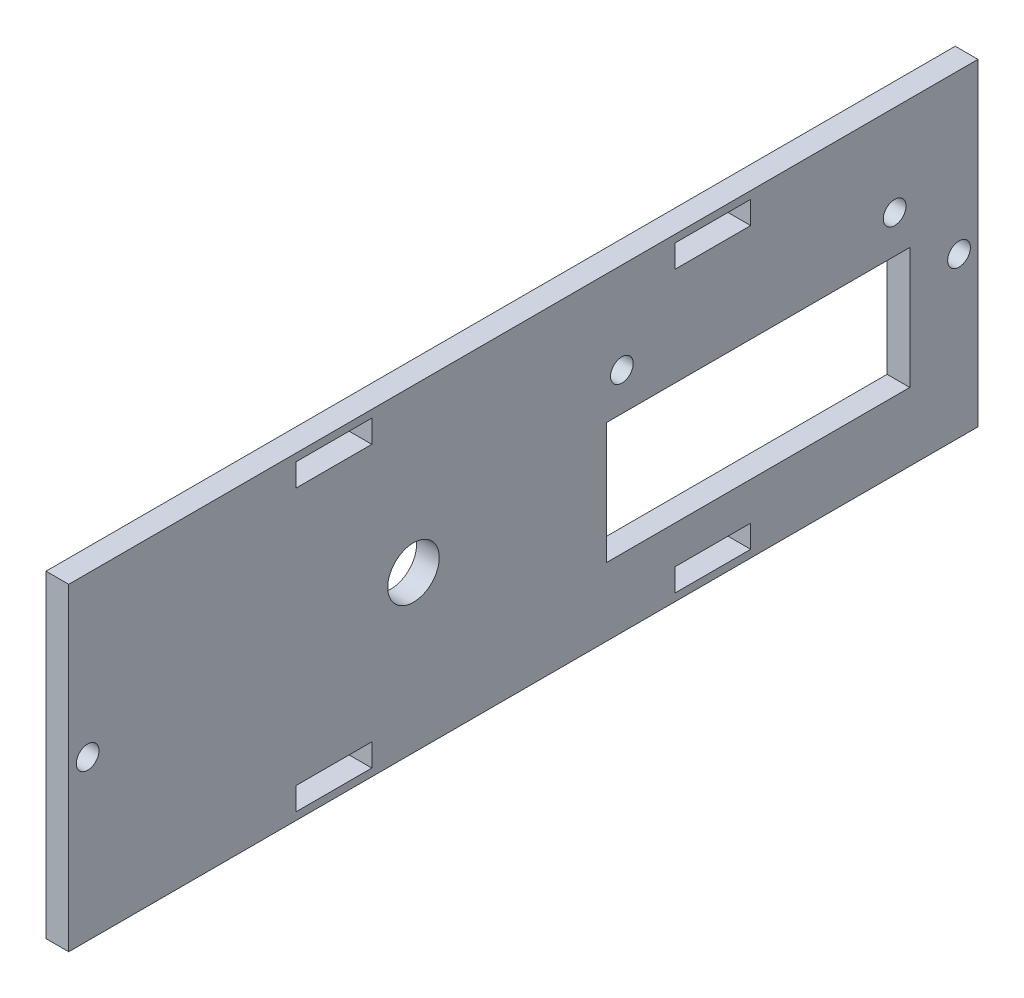
ISO-10303-21;
HEADER;
FILE_DESCRIPTION(('STEP AP214'),'2;1');
FILE_NAME('part.step','',(''),(''),'','','');
FILE_SCHEMA(('AUTOMOTIVE_DESIGN { 1 0 10303 214 1 1 1 1 }'));
ENDSEC;
DATA;
#1=APPLICATION_CONTEXT('core data for automotive mechanical design processes');
#2=APPLICATION_PROTOCOL_DEFINITION('international standard','automotive_design',2000,#1);
#3=PRODUCT_CONTEXT('',#1,'mechanical');
#4=PRODUCT('Part','Part','',(#3));
#5=PRODUCT_RELATED_PRODUCT_CATEGORY('part','',(#4));
#6=PRODUCT_DEFINITION_FORMATION('','',#4);
#7=PRODUCT_DEFINITION_CONTEXT('part definition',#1,'design');
#8=PRODUCT_DEFINITION('design','',#6,#7);
#9=PRODUCT_DEFINITION_SHAPE('','',#8);
#10=(LENGTH_UNIT() NAMED_UNIT(*) SI_UNIT(.MILLI.,.METRE.));
#11=(NAMED_UNIT(*) PLANE_ANGLE_UNIT() SI_UNIT($,.RADIAN.));
#12=(NAMED_UNIT(*) SI_UNIT($,.STERADIAN.) SOLID_ANGLE_UNIT());
#13=UNCERTAINTY_MEASURE_WITH_UNIT(LENGTH_MEASURE(1.E-05),#10,'distance_accuracy_value','');
#14=(GEOMETRIC_REPRESENTATION_CONTEXT(3) GLOBAL_UNCERTAINTY_ASSIGNED_CONTEXT((#13)) GLOBAL_UNIT_ASSIGNED_CONTEXT((#10,
#11,#12)) REPRESENTATION_CONTEXT('',''));
#15=CARTESIAN_POINT('',(0.,0.,0.));
#16=DIRECTION('',(0.,0.,1.));
#17=DIRECTION('',(1.,0.,0.));
#18=AXIS2_PLACEMENT_3D('',#15,#16,#17);
#19=CARTESIAN_POINT('',(3.,0.,0.));
#20=DIRECTION('',(1.,0.,0.));
#21=DIRECTION('',(0.,0.,-1.));
#22=AXIS2_PLACEMENT_3D('',#19,#20,#21);
#23=PLANE('',#22);
#24=CARTESIAN_POINT('',(3.,-0.399999999999994,14.5));
#25=DIRECTION('',(1.,0.,0.));
#26=DIRECTION('',(0.,0.,-1.));
#27=AXIS2_PLACEMENT_3D('',#24,#25,#26);
#28=CIRCLE('',#27,3.4);
#29=CARTESIAN_POINT('',(3.,-0.399999999999994,11.1));
#30=VERTEX_POINT('',#29);
#31=EDGE_CURVE('E562',#30,#30,#28,.T.);
#32=ORIENTED_EDGE('',*,*,#31,.F.);
#33=EDGE_LOOP('',(#32));
#34=FACE_BOUND('',#33,.T.);
#35=CARTESIAN_POINT('',(3.,9.00000000000002,-49.));
#36=DIRECTION('',(1.,0.,0.));
#37=DIRECTION('',(0.,0.,-1.));
#38=AXIS2_PLACEMENT_3D('',#35,#36,#37);
#39=CIRCLE('',#38,1.5);
#40=CARTESIAN_POINT('',(3.,9.00000000000002,-50.5));
#41=VERTEX_POINT('',#40);
#42=EDGE_CURVE('E223',#41,#41,#39,.T.);
#43=ORIENTED_EDGE('',*,*,#42,.F.);
#44=EDGE_LOOP('',(#43));
#45=FACE_BOUND('',#44,.T.);
#46=DIRECTION('',(0.,-1.,0.));
#47=VECTOR('',#46,1.);
#48=CARTESIAN_POINT('',(3.,-21.,60.));
#49=LINE('',#48,#47);
#50=CARTESIAN_POINT('',(3.,21.,60.));
#51=VERTEX_POINT('',#50);
#52=CARTESIAN_POINT('',(3.,-21.,60.));
#53=VERTEX_POINT('',#52);
#54=EDGE_CURVE('E363',#51,#53,#49,.T.);
#55=ORIENTED_EDGE('',*,*,#54,.T.);
#56=DIRECTION('',(0.,0.,-1.));
#57=VECTOR('',#56,1.);
#58=CARTESIAN_POINT('',(3.,-21.,-60.));
#59=LINE('',#58,#57);
#60=CARTESIAN_POINT('',(3.,-21.,-60.));
#61=VERTEX_POINT('',#60);
#62=EDGE_CURVE('E366',#53,#61,#59,.T.);
#63=ORIENTED_EDGE('',*,*,#62,.T.);
#64=DIRECTION('',(0.,1.,0.));
#65=VECTOR('',#64,1.);
#66=CARTESIAN_POINT('',(3.,-21.,-60.));
#67=LINE('',#66,#65);
#68=CARTESIAN_POINT('',(3.,21.,-60.));
#69=VERTEX_POINT('',#68);
#70=EDGE_CURVE('E369',#61,#69,#67,.T.);
#71=ORIENTED_EDGE('',*,*,#70,.T.);
#72=DIRECTION('',(0.,0.,1.));
#73=VECTOR('',#72,1.);
#74=CARTESIAN_POINT('',(3.,21.,-60.));
#75=LINE('',#74,#73);
#76=EDGE_CURVE('E371',#69,#51,#75,.T.);
#77=ORIENTED_EDGE('',*,*,#76,.T.);
#78=EDGE_LOOP('',(#55,#63,#71,#77));
#79=FACE_BOUND('',#78,.T.);
#80=CARTESIAN_POINT('',(3.,0.,57.5));
#81=DIRECTION('',(1.,0.,0.));
#82=DIRECTION('',(0.,0.,1.));
#83=AXIS2_PLACEMENT_3D('',#80,#81,#82);
#84=CIRCLE('',#83,1.5);
#85=CARTESIAN_POINT('',(3.,0.,59.));
#86=VERTEX_POINT('',#85);
#87=EDGE_CURVE('E357',#86,#86,#84,.T.);
#88=ORIENTED_EDGE('',*,*,#87,.F.);
#89=EDGE_LOOP('',(#88));
#90=FACE_BOUND('',#89,.T.);
#91=DIRECTION('',(0.,0.,-1.));
#92=VECTOR('',#91,1.);
#93=CARTESIAN_POINT('',(3.,-12.,-11.));
#94=LINE('',#93,#92);
#95=CARTESIAN_POINT('',(3.,-12.,-11.));
#96=VERTEX_POINT('',#95);
#97=CARTESIAN_POINT('',(3.,-12.,-51.));
#98=VERTEX_POINT('',#97);
#99=EDGE_CURVE('E328',#96,#98,#94,.T.);
#100=ORIENTED_EDGE('',*,*,#99,.F.);
#101=DIRECTION('',(0.,-1.,0.));
#102=VECTOR('',#101,1.);
#103=CARTESIAN_POINT('',(3.,4.00000000000001,-11.));
#104=LINE('',#103,#102);
#105=CARTESIAN_POINT('',(3.,4.00000000000001,-11.));
#106=VERTEX_POINT('',#105);
#107=EDGE_CURVE('E326',#106,#96,#104,.T.);
#108=ORIENTED_EDGE('',*,*,#107,.F.);
#109=DIRECTION('',(0.,0.,1.));
#110=VECTOR('',#109,1.);
#111=CARTESIAN_POINT('',(3.,4.00000000000002,-51.));
#112=LINE('',#111,#110);
#113=CARTESIAN_POINT('',(3.,4.00000000000002,-51.));
#114=VERTEX_POINT('',#113);
#115=EDGE_CURVE('E334',#114,#106,#112,.T.);
#116=ORIENTED_EDGE('',*,*,#115,.F.);
#117=DIRECTION('',(0.,1.,0.));
#118=VECTOR('',#117,1.);
#119=CARTESIAN_POINT('',(3.,-12.,-51.));
#120=LINE('',#119,#118);
#121=EDGE_CURVE('E331',#98,#114,#120,.T.);
#122=ORIENTED_EDGE('',*,*,#121,.F.);
#123=EDGE_LOOP('',(#100,#108,#116,#122));
#124=FACE_BOUND('',#123,.T.);
#125=DIRECTION('',(0.,0.,1.));
#126=VECTOR('',#125,1.);
#127=CARTESIAN_POINT('',(3.,20.,-30.));
#128=LINE('',#127,#126);
#129=CARTESIAN_POINT('',(3.,20.,-30.));
#130=VERTEX_POINT('',#129);
#131=CARTESIAN_POINT('',(3.,20.,-20.));
#132=VERTEX_POINT('',#131);
#133=EDGE_CURVE('E297',#130,#132,#128,.T.);
#134=ORIENTED_EDGE('',*,*,#133,.F.);
#135=DIRECTION('',(0.,1.,0.));
#136=VECTOR('',#135,1.);
#137=CARTESIAN_POINT('',(3.,20.,-30.));
#138=LINE('',#137,#136);
#139=CARTESIAN_POINT('',(3.,17.,-30.));
#140=VERTEX_POINT('',#139);
#141=EDGE_CURVE('E295',#140,#130,#138,.T.);
#142=ORIENTED_EDGE('',*,*,#141,.F.);
#143=DIRECTION('',(0.,0.,-1.));
#144=VECTOR('',#143,1.);
#145=CARTESIAN_POINT('',(3.,17.,-30.));
#146=LINE('',#145,#144);
#147=CARTESIAN_POINT('',(3.,17.,-20.));
#148=VERTEX_POINT('',#147);
#149=EDGE_CURVE('E303',#148,#140,#146,.T.);
#150=ORIENTED_EDGE('',*,*,#149,.F.);
#151=DIRECTION('',(0.,-1.,0.));
#152=VECTOR('',#151,1.);
#153=CARTESIAN_POINT('',(3.,20.,-20.));
#154=LINE('',#153,#152);
#155=EDGE_CURVE('E300',#132,#148,#154,.T.);
#156=ORIENTED_EDGE('',*,*,#155,.F.);
#157=EDGE_LOOP('',(#134,#142,#150,#156));
#158=FACE_BOUND('',#157,.T.);
#159=DIRECTION('',(0.,0.,1.));
#160=VECTOR('',#159,1.);
#161=CARTESIAN_POINT('',(3.,-17.,-30.));
#162=LINE('',#161,#160);
#163=CARTESIAN_POINT('',(3.,-17.,-30.));
#164=VERTEX_POINT('',#163);
#165=CARTESIAN_POINT('',(3.,-17.,-20.));
#166=VERTEX_POINT('',#165);
#167=EDGE_CURVE('E266',#164,#166,#162,.T.);
#168=ORIENTED_EDGE('',*,*,#167,.F.);
#169=DIRECTION('',(0.,1.,0.));
#170=VECTOR('',#169,1.);
#171=CARTESIAN_POINT('',(3.,-17.,-30.));
#172=LINE('',#171,#170);
#173=CARTESIAN_POINT('',(3.,-20.,-30.));
#174=VERTEX_POINT('',#173);
#175=EDGE_CURVE('E264',#174,#164,#172,.T.);
#176=ORIENTED_EDGE('',*,*,#175,.F.);
#177=DIRECTION('',(0.,0.,-1.));
#178=VECTOR('',#177,1.);
#179=CARTESIAN_POINT('',(3.,-20.,-30.));
#180=LINE('',#179,#178);
#181=CARTESIAN_POINT('',(3.,-20.,-20.));
#182=VERTEX_POINT('',#181);
#183=EDGE_CURVE('E272',#182,#174,#180,.T.);
#184=ORIENTED_EDGE('',*,*,#183,.F.);
#185=DIRECTION('',(0.,-1.,0.));
#186=VECTOR('',#185,1.);
#187=CARTESIAN_POINT('',(3.,-17.,-20.));
#188=LINE('',#187,#186);
#189=EDGE_CURVE('E269',#166,#182,#188,.T.);
#190=ORIENTED_EDGE('',*,*,#189,.F.);
#191=EDGE_LOOP('',(#168,#176,#184,#190));
#192=FACE_BOUND('',#191,.T.);
#193=DIRECTION('',(0.,0.,1.));
#194=VECTOR('',#193,1.);
#195=CARTESIAN_POINT('',(3.,20.,20.));
#196=LINE('',#195,#194);
#197=CARTESIAN_POINT('',(3.,20.,20.));
#198=VERTEX_POINT('',#197);
#199=CARTESIAN_POINT('',(3.,20.,30.));
#200=VERTEX_POINT('',#199);
#201=EDGE_CURVE('E235',#198,#200,#196,.T.);
#202=ORIENTED_EDGE('',*,*,#201,.F.);
#203=DIRECTION('',(0.,1.,0.));
#204=VECTOR('',#203,1.);
#205=CARTESIAN_POINT('',(3.,20.,20.));
#206=LINE('',#205,#204);
#207=CARTESIAN_POINT('',(3.,17.,20.));
#208=VERTEX_POINT('',#207);
#209=EDGE_CURVE('E233',#208,#198,#206,.T.);
#210=ORIENTED_EDGE('',*,*,#209,.F.);
#211=DIRECTION('',(0.,0.,-1.));
#212=VECTOR('',#211,1.);
#213=CARTESIAN_POINT('',(3.,17.,20.));
#214=LINE('',#213,#212);
#215=CARTESIAN_POINT('',(3.,17.,30.));
#216=VERTEX_POINT('',#215);
#217=EDGE_CURVE('E241',#216,#208,#214,.T.);
#218=ORIENTED_EDGE('',*,*,#217,.F.);
#219=DIRECTION('',(0.,-1.,0.));
#220=VECTOR('',#219,1.);
#221=CARTESIAN_POINT('',(3.,20.,30.));
#222=LINE('',#221,#220);
#223=EDGE_CURVE('E238',#200,#216,#222,.T.);
#224=ORIENTED_EDGE('',*,*,#223,.F.);
#225=EDGE_LOOP('',(#202,#210,#218,#224));
#226=FACE_BOUND('',#225,.T.);
#227=DIRECTION('',(0.,0.,1.));
#228=VECTOR('',#227,1.);
#229=CARTESIAN_POINT('',(3.,-17.,20.));
#230=LINE('',#229,#228);
#231=CARTESIAN_POINT('',(3.,-17.,20.));
#232=VERTEX_POINT('',#231);
#233=CARTESIAN_POINT('',(3.,-17.,30.));
#234=VERTEX_POINT('',#233);
#235=EDGE_CURVE('E202',#232,#234,#230,.T.);
#236=ORIENTED_EDGE('',*,*,#235,.F.);
#237=DIRECTION('',(0.,1.,0.));
#238=VECTOR('',#237,1.);
#239=CARTESIAN_POINT('',(3.,-17.,20.));
#240=LINE('',#239,#238);
#241=CARTESIAN_POINT('',(3.,-20.,20.));
#242=VERTEX_POINT('',#241);
#243=EDGE_CURVE('E194',#242,#232,#240,.T.);
#244=ORIENTED_EDGE('',*,*,#243,.F.);
#245=DIRECTION('',(0.,0.,-1.));
#246=VECTOR('',#245,1.);
#247=CARTESIAN_POINT('',(3.,-20.,20.));
#248=LINE('',#247,#246);
#249=CARTESIAN_POINT('',(3.,-20.,30.));
#250=VERTEX_POINT('',#249);
#251=EDGE_CURVE('E217',#250,#242,#248,.T.);
#252=ORIENTED_EDGE('',*,*,#251,.F.);
#253=DIRECTION('',(0.,-1.,0.));
#254=VECTOR('',#253,1.);
#255=CARTESIAN_POINT('',(3.,-17.,30.));
#256=LINE('',#255,#254);
#257=EDGE_CURVE('E215',#234,#250,#256,.T.);
#258=ORIENTED_EDGE('',*,*,#257,.F.);
#259=EDGE_LOOP('',(#236,#244,#252,#258));
#260=FACE_BOUND('',#259,.T.);
#261=CARTESIAN_POINT('',(3.,9.00000000000002,-13.));
#262=DIRECTION('',(1.,0.,0.));
#263=DIRECTION('',(0.,0.,-1.));
#264=AXIS2_PLACEMENT_3D('',#261,#262,#263);
#265=CIRCLE('',#264,1.50000000000001);
#266=CARTESIAN_POINT('',(3.,9.00000000000002,-14.5));
#267=VERTEX_POINT('',#266);
#268=EDGE_CURVE('E566',#267,#267,#265,.T.);
#269=ORIENTED_EDGE('',*,*,#268,.F.);
#270=EDGE_LOOP('',(#269));
#271=FACE_BOUND('',#270,.T.);
#272=CARTESIAN_POINT('',(3.,0.,-57.5));
#273=DIRECTION('',(1.,0.,0.));
#274=DIRECTION('',(0.,0.,-1.));
#275=AXIS2_PLACEMENT_3D('',#272,#273,#274);
#276=CIRCLE('',#275,1.5);
#277=CARTESIAN_POINT('',(3.,0.,-59.));
#278=VERTEX_POINT('',#277);
#279=EDGE_CURVE('E557',#278,#278,#276,.T.);
#280=ORIENTED_EDGE('',*,*,#279,.F.);
#281=EDGE_LOOP('',(#280));
#282=FACE_BOUND('',#281,.T.);
#283=ADVANCED_FACE('F33',(#34,#45,#79,#90,#124,#158,#192,#226,#260,#271,#282),#23,.T.);
#284=CARTESIAN_POINT('',(0.,0.,0.));
#285=DIRECTION('',(1.,0.,0.));
#286=DIRECTION('',(0.,0.,-1.));
#287=AXIS2_PLACEMENT_3D('',#284,#285,#286);
#288=PLANE('',#287);
#289=DIRECTION('',(0.,1.,0.));
#290=VECTOR('',#289,1.);
#291=CARTESIAN_POINT('',(0.,20.,20.));
#292=LINE('',#291,#290);
#293=CARTESIAN_POINT('',(0.,17.,20.));
#294=VERTEX_POINT('',#293);
#295=CARTESIAN_POINT('',(0.,20.,20.));
#296=VERTEX_POINT('',#295);
#297=EDGE_CURVE('E210',#294,#296,#292,.T.);
#298=ORIENTED_EDGE('',*,*,#297,.T.);
#299=DIRECTION('',(0.,0.,1.));
#300=VECTOR('',#299,1.);
#301=CARTESIAN_POINT('',(0.,20.,20.));
#302=LINE('',#301,#300);
#303=CARTESIAN_POINT('',(0.,20.,30.));
#304=VERTEX_POINT('',#303);
#305=EDGE_CURVE('E246',#296,#304,#302,.T.);
#306=ORIENTED_EDGE('',*,*,#305,.T.);
#307=DIRECTION('',(0.,-1.,0.));
#308=VECTOR('',#307,1.);
#309=CARTESIAN_POINT('',(0.,20.,30.));
#310=LINE('',#309,#308);
#311=CARTESIAN_POINT('',(0.,17.,30.));
#312=VERTEX_POINT('',#311);
#313=EDGE_CURVE('E249',#304,#312,#310,.T.);
#314=ORIENTED_EDGE('',*,*,#313,.T.);
#315=DIRECTION('',(0.,0.,-1.));
#316=VECTOR('',#315,1.);
#317=CARTESIAN_POINT('',(0.,17.,20.));
#318=LINE('',#317,#316);
#319=EDGE_CURVE('E236',#312,#294,#318,.T.);
#320=ORIENTED_EDGE('',*,*,#319,.T.);
#321=EDGE_LOOP('',(#298,#306,#314,#320));
#322=FACE_BOUND('',#321,.T.);
#323=DIRECTION('',(0.,1.,0.));
#324=VECTOR('',#323,1.);
#325=CARTESIAN_POINT('',(0.,20.,-30.));
#326=LINE('',#325,#324);
#327=CARTESIAN_POINT('',(0.,17.,-30.));
#328=VERTEX_POINT('',#327);
#329=CARTESIAN_POINT('',(0.,20.,-30.));
#330=VERTEX_POINT('',#329);
#331=EDGE_CURVE('E294',#328,#330,#326,.T.);
#332=ORIENTED_EDGE('',*,*,#331,.T.);
#333=DIRECTION('',(0.,0.,1.));
#334=VECTOR('',#333,1.);
#335=CARTESIAN_POINT('',(0.,20.,-30.));
#336=LINE('',#335,#334);
#337=CARTESIAN_POINT('',(0.,20.,-20.));
#338=VERTEX_POINT('',#337);
#339=EDGE_CURVE('E308',#330,#338,#336,.T.);
#340=ORIENTED_EDGE('',*,*,#339,.T.);
#341=DIRECTION('',(0.,-1.,0.));
#342=VECTOR('',#341,1.);
#343=CARTESIAN_POINT('',(0.,20.,-20.));
#344=LINE('',#343,#342);
#345=CARTESIAN_POINT('',(0.,17.,-20.));
#346=VERTEX_POINT('',#345);
#347=EDGE_CURVE('E311',#338,#346,#344,.T.);
#348=ORIENTED_EDGE('',*,*,#347,.T.);
#349=DIRECTION('',(0.,0.,-1.));
#350=VECTOR('',#349,1.);
#351=CARTESIAN_POINT('',(0.,17.,-30.));
#352=LINE('',#351,#350);
#353=EDGE_CURVE('E298',#346,#328,#352,.T.);
#354=ORIENTED_EDGE('',*,*,#353,.T.);
#355=EDGE_LOOP('',(#332,#340,#348,#354));
#356=FACE_BOUND('',#355,.T.);
#357=CARTESIAN_POINT('',(0.,0.,57.5));
#358=DIRECTION('',(1.,0.,0.));
#359=DIRECTION('',(0.,0.,1.));
#360=AXIS2_PLACEMENT_3D('',#357,#358,#359);
#361=CIRCLE('',#360,1.5);
#362=CARTESIAN_POINT('',(0.,0.,59.));
#363=VERTEX_POINT('',#362);
#364=EDGE_CURVE('E356',#363,#363,#361,.T.);
#365=ORIENTED_EDGE('',*,*,#364,.T.);
#366=EDGE_LOOP('',(#365));
#367=FACE_BOUND('',#366,.T.);
#368=DIRECTION('',(0.,-1.,0.));
#369=VECTOR('',#368,1.);
#370=CARTESIAN_POINT('',(0.,-21.,60.));
#371=LINE('',#370,#369);
#372=CARTESIAN_POINT('',(0.,21.,60.));
#373=VERTEX_POINT('',#372);
#374=CARTESIAN_POINT('',(0.,-21.,60.));
#375=VERTEX_POINT('',#374);
#376=EDGE_CURVE('E360',#373,#375,#371,.T.);
#377=ORIENTED_EDGE('',*,*,#376,.F.);
#378=DIRECTION('',(0.,0.,1.));
#379=VECTOR('',#378,1.);
#380=CARTESIAN_POINT('',(0.,21.,-60.));
#381=LINE('',#380,#379);
#382=CARTESIAN_POINT('',(0.,21.,-60.));
#383=VERTEX_POINT('',#382);
#384=EDGE_CURVE('E367',#383,#373,#381,.T.);
#385=ORIENTED_EDGE('',*,*,#384,.F.);
#386=DIRECTION('',(0.,1.,0.));
#387=VECTOR('',#386,1.);
#388=CARTESIAN_POINT('',(0.,-21.,-60.));
#389=LINE('',#388,#387);
#390=CARTESIAN_POINT('',(0.,-21.,-60.));
#391=VERTEX_POINT('',#390);
#392=EDGE_CURVE('E378',#391,#383,#389,.T.);
#393=ORIENTED_EDGE('',*,*,#392,.F.);
#394=DIRECTION('',(0.,0.,-1.));
#395=VECTOR('',#394,1.);
#396=CARTESIAN_POINT('',(0.,-21.,-60.));
#397=LINE('',#396,#395);
#398=EDGE_CURVE('E376',#375,#391,#397,.T.);
#399=ORIENTED_EDGE('',*,*,#398,.F.);
#400=EDGE_LOOP('',(#377,#385,#393,#399));
#401=FACE_BOUND('',#400,.T.);
#402=DIRECTION('',(0.,-1.,0.));
#403=VECTOR('',#402,1.);
#404=CARTESIAN_POINT('',(0.,4.00000000000001,-11.));
#405=LINE('',#404,#403);
#406=CARTESIAN_POINT('',(0.,4.00000000000001,-11.));
#407=VERTEX_POINT('',#406);
#408=CARTESIAN_POINT('',(0.,-12.,-11.));
#409=VERTEX_POINT('',#408);
#410=EDGE_CURVE('E325',#407,#409,#405,.T.);
#411=ORIENTED_EDGE('',*,*,#410,.T.);
#412=DIRECTION('',(0.,0.,-1.));
#413=VECTOR('',#412,1.);
#414=CARTESIAN_POINT('',(0.,-12.,-11.));
#415=LINE('',#414,#413);
#416=CARTESIAN_POINT('',(0.,-12.,-51.));
#417=VERTEX_POINT('',#416);
#418=EDGE_CURVE('E339',#409,#417,#415,.T.);
#419=ORIENTED_EDGE('',*,*,#418,.T.);
#420=DIRECTION('',(0.,1.,0.));
#421=VECTOR('',#420,1.);
#422=CARTESIAN_POINT('',(0.,-12.,-51.));
#423=LINE('',#422,#421);
#424=CARTESIAN_POINT('',(0.,4.00000000000002,-51.));
#425=VERTEX_POINT('',#424);
#426=EDGE_CURVE('E342',#417,#425,#423,.T.);
#427=ORIENTED_EDGE('',*,*,#426,.T.);
#428=DIRECTION('',(0.,0.,1.));
#429=VECTOR('',#428,1.);
#430=CARTESIAN_POINT('',(0.,4.00000000000002,-51.));
#431=LINE('',#430,#429);
#432=EDGE_CURVE('E329',#425,#407,#431,.T.);
#433=ORIENTED_EDGE('',*,*,#432,.T.);
#434=EDGE_LOOP('',(#411,#419,#427,#433));
#435=FACE_BOUND('',#434,.T.);
#436=DIRECTION('',(0.,1.,0.));
#437=VECTOR('',#436,1.);
#438=CARTESIAN_POINT('',(0.,-17.,-30.));
#439=LINE('',#438,#437);
#440=CARTESIAN_POINT('',(0.,-20.,-30.));
#441=VERTEX_POINT('',#440);
#442=CARTESIAN_POINT('',(0.,-17.,-30.));
#443=VERTEX_POINT('',#442);
#444=EDGE_CURVE('E263',#441,#443,#439,.T.);
#445=ORIENTED_EDGE('',*,*,#444,.T.);
#446=DIRECTION('',(0.,0.,1.));
#447=VECTOR('',#446,1.);
#448=CARTESIAN_POINT('',(0.,-17.,-30.));
#449=LINE('',#448,#447);
#450=CARTESIAN_POINT('',(0.,-17.,-20.));
#451=VERTEX_POINT('',#450);
#452=EDGE_CURVE('E277',#443,#451,#449,.T.);
#453=ORIENTED_EDGE('',*,*,#452,.T.);
#454=DIRECTION('',(0.,-1.,0.));
#455=VECTOR('',#454,1.);
#456=CARTESIAN_POINT('',(0.,-17.,-20.));
#457=LINE('',#456,#455);
#458=CARTESIAN_POINT('',(0.,-20.,-20.));
#459=VERTEX_POINT('',#458);
#460=EDGE_CURVE('E280',#451,#459,#457,.T.);
#461=ORIENTED_EDGE('',*,*,#460,.T.);
#462=DIRECTION('',(0.,0.,-1.));
#463=VECTOR('',#462,1.);
#464=CARTESIAN_POINT('',(0.,-20.,-30.));
#465=LINE('',#464,#463);
#466=EDGE_CURVE('E267',#459,#441,#465,.T.);
#467=ORIENTED_EDGE('',*,*,#466,.T.);
#468=EDGE_LOOP('',(#445,#453,#461,#467));
#469=FACE_BOUND('',#468,.T.);
#470=DIRECTION('',(0.,1.,0.));
#471=VECTOR('',#470,1.);
#472=CARTESIAN_POINT('',(0.,-17.,20.));
#473=LINE('',#472,#471);
#474=CARTESIAN_POINT('',(0.,-20.,20.));
#475=VERTEX_POINT('',#474);
#476=CARTESIAN_POINT('',(0.,-17.,20.));
#477=VERTEX_POINT('',#476);
#478=EDGE_CURVE('E56',#475,#477,#473,.T.);
#479=ORIENTED_EDGE('',*,*,#478,.T.);
#480=DIRECTION('',(0.,0.,1.));
#481=VECTOR('',#480,1.);
#482=CARTESIAN_POINT('',(0.,-17.,20.));
#483=LINE('',#482,#481);
#484=CARTESIAN_POINT('',(0.,-17.,30.));
#485=VERTEX_POINT('',#484);
#486=EDGE_CURVE('E209',#477,#485,#483,.T.);
#487=ORIENTED_EDGE('',*,*,#486,.T.);
#488=DIRECTION('',(0.,-1.,0.));
#489=VECTOR('',#488,1.);
#490=CARTESIAN_POINT('',(0.,-17.,30.));
#491=LINE('',#490,#489);
#492=CARTESIAN_POINT('',(0.,-20.,30.));
#493=VERTEX_POINT('',#492);
#494=EDGE_CURVE('E225',#485,#493,#491,.T.);
#495=ORIENTED_EDGE('',*,*,#494,.T.);
#496=DIRECTION('',(0.,0.,-1.));
#497=VECTOR('',#496,1.);
#498=CARTESIAN_POINT('',(0.,-20.,20.));
#499=LINE('',#498,#497);
#500=EDGE_CURVE('E203',#493,#475,#499,.T.);
#501=ORIENTED_EDGE('',*,*,#500,.T.);
#502=EDGE_LOOP('',(#479,#487,#495,#501));
#503=FACE_BOUND('',#502,.T.);
#504=CARTESIAN_POINT('',(0.,9.00000000000002,-49.));
#505=DIRECTION('',(1.,0.,0.));
#506=DIRECTION('',(0.,0.,-1.));
#507=AXIS2_PLACEMENT_3D('',#504,#505,#506);
#508=CIRCLE('',#507,1.5);
#509=CARTESIAN_POINT('',(0.,9.00000000000002,-50.5));
#510=VERTEX_POINT('',#509);
#511=EDGE_CURVE('E544',#510,#510,#508,.T.);
#512=ORIENTED_EDGE('',*,*,#511,.T.);
#513=EDGE_LOOP('',(#512));
#514=FACE_BOUND('',#513,.T.);
#515=CARTESIAN_POINT('',(0.,9.00000000000002,-13.));
#516=DIRECTION('',(1.,0.,0.));
#517=DIRECTION('',(0.,0.,-1.));
#518=AXIS2_PLACEMENT_3D('',#515,#516,#517);
#519=CIRCLE('',#518,1.50000000000001);
#520=CARTESIAN_POINT('',(0.,9.00000000000002,-14.5));
#521=VERTEX_POINT('',#520);
#522=EDGE_CURVE('E548',#521,#521,#519,.T.);
#523=ORIENTED_EDGE('',*,*,#522,.T.);
#524=EDGE_LOOP('',(#523));
#525=FACE_BOUND('',#524,.T.);
#526=CARTESIAN_POINT('',(0.,-0.399999999999994,14.5));
#527=DIRECTION('',(1.,0.,0.));
#528=DIRECTION('',(0.,0.,-1.));
#529=AXIS2_PLACEMENT_3D('',#526,#527,#528);
#530=CIRCLE('',#529,3.4);
#531=CARTESIAN_POINT('',(0.,-0.399999999999994,11.1));
#532=VERTEX_POINT('',#531);
#533=EDGE_CURVE('E552',#532,#532,#530,.T.);
#534=ORIENTED_EDGE('',*,*,#533,.T.);
#535=EDGE_LOOP('',(#534));
#536=FACE_BOUND('',#535,.T.);
#537=CARTESIAN_POINT('',(0.,0.,-57.5));
#538=DIRECTION('',(1.,0.,0.));
#539=DIRECTION('',(0.,0.,-1.));
#540=AXIS2_PLACEMENT_3D('',#537,#538,#539);
#541=CIRCLE('',#540,1.5);
#542=CARTESIAN_POINT('',(0.,0.,-59.));
#543=VERTEX_POINT('',#542);
#544=EDGE_CURVE('E555',#543,#543,#541,.T.);
#545=ORIENTED_EDGE('',*,*,#544,.T.);
#546=EDGE_LOOP('',(#545));
#547=FACE_BOUND('',#546,.T.);
#548=ADVANCED_FACE('F396',(#322,#356,#367,#401,#435,#469,#503,#514,#525,#536,#547),#288,.F.);
#549=CARTESIAN_POINT('',(3.,-21.,60.));
#550=DIRECTION('',(0.,0.,-1.));
#551=DIRECTION('',(0.,1.,0.));
#552=AXIS2_PLACEMENT_3D('',#549,#550,#551);
#553=PLANE('',#552);
#554=ORIENTED_EDGE('',*,*,#376,.T.);
#555=DIRECTION('',(-1.,0.,0.));
#556=VECTOR('',#555,1.);
#557=CARTESIAN_POINT('',(3.,-21.,60.));
#558=LINE('',#557,#556);
#559=EDGE_CURVE('E11',#53,#375,#558,.T.);
#560=ORIENTED_EDGE('',*,*,#559,.F.);
#561=ORIENTED_EDGE('',*,*,#54,.F.);
#562=DIRECTION('',(-1.,0.,0.));
#563=VECTOR('',#562,1.);
#564=CARTESIAN_POINT('',(3.,21.,60.));
#565=LINE('',#564,#563);
#566=EDGE_CURVE('E373',#51,#373,#565,.T.);
#567=ORIENTED_EDGE('',*,*,#566,.T.);
#568=EDGE_LOOP('',(#554,#560,#561,#567));
#569=FACE_BOUND('',#568,.T.);
#570=ADVANCED_FACE('F35',(#569),#553,.F.);
#571=CARTESIAN_POINT('',(3.,-21.,-60.));
#572=DIRECTION('',(0.,1.,0.));
#573=DIRECTION('',(0.,0.,1.));
#574=AXIS2_PLACEMENT_3D('',#571,#572,#573);
#575=PLANE('',#574);
#576=ORIENTED_EDGE('',*,*,#398,.T.);
#577=DIRECTION('',(-1.,0.,0.));
#578=VECTOR('',#577,1.);
#579=CARTESIAN_POINT('',(3.,-21.,-60.));
#580=LINE('',#579,#578);
#581=EDGE_CURVE('E41',#61,#391,#580,.T.);
#582=ORIENTED_EDGE('',*,*,#581,.F.);
#583=ORIENTED_EDGE('',*,*,#62,.F.);
#584=ORIENTED_EDGE('',*,*,#559,.T.);
#585=EDGE_LOOP('',(#576,#582,#583,#584));
#586=FACE_BOUND('',#585,.T.);
#587=ADVANCED_FACE('F407',(#586),#575,.F.);
#588=CARTESIAN_POINT('',(3.,-21.,-60.));
#589=DIRECTION('',(0.,0.,1.));
#590=DIRECTION('',(0.,-1.,0.));
#591=AXIS2_PLACEMENT_3D('',#588,#589,#590);
#592=PLANE('',#591);
#593=ORIENTED_EDGE('',*,*,#392,.T.);
#594=DIRECTION('',(-1.,0.,0.));
#595=VECTOR('',#594,1.);
#596=CARTESIAN_POINT('',(3.,21.,-60.));
#597=LINE('',#596,#595);
#598=EDGE_CURVE('E383',#69,#383,#597,.T.);
#599=ORIENTED_EDGE('',*,*,#598,.F.);
#600=ORIENTED_EDGE('',*,*,#70,.F.);
#601=ORIENTED_EDGE('',*,*,#581,.T.);
#602=EDGE_LOOP('',(#593,#599,#600,#601));
#603=FACE_BOUND('',#602,.T.);
#604=ADVANCED_FACE('F390',(#603),#592,.F.);
#605=CARTESIAN_POINT('',(3.,21.,-60.));
#606=DIRECTION('',(0.,-1.,0.));
#607=DIRECTION('',(0.,0.,-1.));
#608=AXIS2_PLACEMENT_3D('',#605,#606,#607);
#609=PLANE('',#608);
#610=ORIENTED_EDGE('',*,*,#384,.T.);
#611=ORIENTED_EDGE('',*,*,#566,.F.);
#612=ORIENTED_EDGE('',*,*,#76,.F.);
#613=ORIENTED_EDGE('',*,*,#598,.T.);
#614=EDGE_LOOP('',(#610,#611,#612,#613));
#615=FACE_BOUND('',#614,.T.);
#616=ADVANCED_FACE('F400',(#615),#609,.F.);
#617=CARTESIAN_POINT('',(3.,0.,57.5));
#618=DIRECTION('',(-1.,0.,0.));
#619=DIRECTION('',(0.,0.,1.));
#620=AXIS2_PLACEMENT_3D('',#617,#618,#619);
#621=CYLINDRICAL_SURFACE('',#620,1.5);
#622=ORIENTED_EDGE('',*,*,#87,.T.);
#623=EDGE_LOOP('',(#622));
#624=FACE_BOUND('',#623,.T.);
#625=ORIENTED_EDGE('',*,*,#364,.F.);
#626=EDGE_LOOP('',(#625));
#627=FACE_BOUND('',#626,.T.);
#628=ADVANCED_FACE('F425',(#624,#627),#621,.F.);
#629=CARTESIAN_POINT('',(3.,4.00000000000001,-11.));
#630=DIRECTION('',(0.,0.,-1.));
#631=DIRECTION('',(-1.,0.,0.));
#632=AXIS2_PLACEMENT_3D('',#629,#630,#631);
#633=PLANE('',#632);
#634=ORIENTED_EDGE('',*,*,#410,.F.);
#635=DIRECTION('',(-1.,0.,0.));
#636=VECTOR('',#635,1.);
#637=CARTESIAN_POINT('',(3.,4.00000000000001,-11.));
#638=LINE('',#637,#636);
#639=EDGE_CURVE('E336',#106,#407,#638,.T.);
#640=ORIENTED_EDGE('',*,*,#639,.F.);
#641=ORIENTED_EDGE('',*,*,#107,.T.);
#642=DIRECTION('',(-1.,0.,0.));
#643=VECTOR('',#642,1.);
#644=CARTESIAN_POINT('',(3.,-12.,-11.));
#645=LINE('',#644,#643);
#646=EDGE_CURVE('E353',#96,#409,#645,.T.);
#647=ORIENTED_EDGE('',*,*,#646,.T.);
#648=EDGE_LOOP('',(#634,#640,#641,#647));
#649=FACE_BOUND('',#648,.T.);
#650=ADVANCED_FACE('F432',(#649),#633,.T.);
#651=CARTESIAN_POINT('',(3.,-12.,-11.));
#652=DIRECTION('',(0.,1.,0.));
#653=DIRECTION('',(0.,0.,1.));
#654=AXIS2_PLACEMENT_3D('',#651,#652,#653);
#655=PLANE('',#654);
#656=ORIENTED_EDGE('',*,*,#418,.F.);
#657=ORIENTED_EDGE('',*,*,#646,.F.);
#658=ORIENTED_EDGE('',*,*,#99,.T.);
#659=DIRECTION('',(-1.,0.,0.));
#660=VECTOR('',#659,1.);
#661=CARTESIAN_POINT('',(3.,-12.,-51.));
#662=LINE('',#661,#660);
#663=EDGE_CURVE('E351',#98,#417,#662,.T.);
#664=ORIENTED_EDGE('',*,*,#663,.T.);
#665=EDGE_LOOP('',(#656,#657,#658,#664));
#666=FACE_BOUND('',#665,.T.);
#667=ADVANCED_FACE('F437',(#666),#655,.T.);
#668=CARTESIAN_POINT('',(3.,-12.,-51.));
#669=DIRECTION('',(0.,0.,1.));
#670=DIRECTION('',(1.,0.,0.));
#671=AXIS2_PLACEMENT_3D('',#668,#669,#670);
#672=PLANE('',#671);
#673=ORIENTED_EDGE('',*,*,#426,.F.);
#674=ORIENTED_EDGE('',*,*,#663,.F.);
#675=ORIENTED_EDGE('',*,*,#121,.T.);
#676=DIRECTION('',(-1.,0.,0.));
#677=VECTOR('',#676,1.);
#678=CARTESIAN_POINT('',(3.,4.00000000000002,-51.));
#679=LINE('',#678,#677);
#680=EDGE_CURVE('E349',#114,#425,#679,.T.);
#681=ORIENTED_EDGE('',*,*,#680,.T.);
#682=EDGE_LOOP('',(#673,#674,#675,#681));
#683=FACE_BOUND('',#682,.T.);
#684=ADVANCED_FACE('F523',(#683),#672,.T.);
#685=CARTESIAN_POINT('',(3.,4.00000000000002,-51.));
#686=DIRECTION('',(0.,-1.,0.));
#687=DIRECTION('',(0.,0.,-1.));
#688=AXIS2_PLACEMENT_3D('',#685,#686,#687);
#689=PLANE('',#688);
#690=ORIENTED_EDGE('',*,*,#432,.F.);
#691=ORIENTED_EDGE('',*,*,#680,.F.);
#692=ORIENTED_EDGE('',*,*,#115,.T.);
#693=ORIENTED_EDGE('',*,*,#639,.T.);
#694=EDGE_LOOP('',(#690,#691,#692,#693));
#695=FACE_BOUND('',#694,.T.);
#696=ADVANCED_FACE('F519',(#695),#689,.T.);
#697=CARTESIAN_POINT('',(3.,20.,-30.));
#698=DIRECTION('',(0.,0.,1.));
#699=DIRECTION('',(0.,-1.,0.));
#700=AXIS2_PLACEMENT_3D('',#697,#698,#699);
#701=PLANE('',#700);
#702=ORIENTED_EDGE('',*,*,#331,.F.);
#703=DIRECTION('',(-1.,0.,0.));
#704=VECTOR('',#703,1.);
#705=CARTESIAN_POINT('',(3.,17.,-30.));
#706=LINE('',#705,#704);
#707=EDGE_CURVE('E305',#140,#328,#706,.T.);
#708=ORIENTED_EDGE('',*,*,#707,.F.);
#709=ORIENTED_EDGE('',*,*,#141,.T.);
#710=DIRECTION('',(-1.,0.,0.));
#711=VECTOR('',#710,1.);
#712=CARTESIAN_POINT('',(3.,20.,-30.));
#713=LINE('',#712,#711);
#714=EDGE_CURVE('E322',#130,#330,#713,.T.);
#715=ORIENTED_EDGE('',*,*,#714,.T.);
#716=EDGE_LOOP('',(#702,#708,#709,#715));
#717=FACE_BOUND('',#716,.T.);
#718=ADVANCED_FACE('F515',(#717),#701,.T.);
#719=CARTESIAN_POINT('',(3.,20.,-30.));
#720=DIRECTION('',(0.,-1.,0.));
#721=DIRECTION('',(0.,0.,-1.));
#722=AXIS2_PLACEMENT_3D('',#719,#720,#721);
#723=PLANE('',#722);
#724=ORIENTED_EDGE('',*,*,#339,.F.);
#725=ORIENTED_EDGE('',*,*,#714,.F.);
#726=ORIENTED_EDGE('',*,*,#133,.T.);
#727=DIRECTION('',(-1.,0.,0.));
#728=VECTOR('',#727,1.);
#729=CARTESIAN_POINT('',(3.,20.,-20.));
#730=LINE('',#729,#728);
#731=EDGE_CURVE('E320',#132,#338,#730,.T.);
#732=ORIENTED_EDGE('',*,*,#731,.T.);
#733=EDGE_LOOP('',(#724,#725,#726,#732));
#734=FACE_BOUND('',#733,.T.);
#735=ADVANCED_FACE('F511',(#734),#723,.T.);
#736=CARTESIAN_POINT('',(3.,20.,-20.));
#737=DIRECTION('',(0.,0.,-1.));
#738=DIRECTION('',(-1.,0.,0.));
#739=AXIS2_PLACEMENT_3D('',#736,#737,#738);
#740=PLANE('',#739);
#741=ORIENTED_EDGE('',*,*,#347,.F.);
#742=ORIENTED_EDGE('',*,*,#731,.F.);
#743=ORIENTED_EDGE('',*,*,#155,.T.);
#744=DIRECTION('',(-1.,0.,0.));
#745=VECTOR('',#744,1.);
#746=CARTESIAN_POINT('',(3.,17.,-20.));
#747=LINE('',#746,#745);
#748=EDGE_CURVE('E318',#148,#346,#747,.T.);
#749=ORIENTED_EDGE('',*,*,#748,.T.);
#750=EDGE_LOOP('',(#741,#742,#743,#749));
#751=FACE_BOUND('',#750,.T.);
#752=ADVANCED_FACE('F507',(#751),#740,.T.);
#753=CARTESIAN_POINT('',(3.,17.,-30.));
#754=DIRECTION('',(0.,1.,0.));
#755=DIRECTION('',(0.,0.,1.));
#756=AXIS2_PLACEMENT_3D('',#753,#754,#755);
#757=PLANE('',#756);
#758=ORIENTED_EDGE('',*,*,#353,.F.);
#759=ORIENTED_EDGE('',*,*,#748,.F.);
#760=ORIENTED_EDGE('',*,*,#149,.T.);
#761=ORIENTED_EDGE('',*,*,#707,.T.);
#762=EDGE_LOOP('',(#758,#759,#760,#761));
#763=FACE_BOUND('',#762,.T.);
#764=ADVANCED_FACE('F503',(#763),#757,.T.);
#765=CARTESIAN_POINT('',(3.,-17.,-30.));
#766=DIRECTION('',(0.,0.,1.));
#767=DIRECTION('',(0.,-1.,0.));
#768=AXIS2_PLACEMENT_3D('',#765,#766,#767);
#769=PLANE('',#768);
#770=ORIENTED_EDGE('',*,*,#444,.F.);
#771=DIRECTION('',(-1.,0.,0.));
#772=VECTOR('',#771,1.);
#773=CARTESIAN_POINT('',(3.,-20.,-30.));
#774=LINE('',#773,#772);
#775=EDGE_CURVE('E274',#174,#441,#774,.T.);
#776=ORIENTED_EDGE('',*,*,#775,.F.);
#777=ORIENTED_EDGE('',*,*,#175,.T.);
#778=DIRECTION('',(-1.,0.,0.));
#779=VECTOR('',#778,1.);
#780=CARTESIAN_POINT('',(3.,-17.,-30.));
#781=LINE('',#780,#779);
#782=EDGE_CURVE('E291',#164,#443,#781,.T.);
#783=ORIENTED_EDGE('',*,*,#782,.T.);
#784=EDGE_LOOP('',(#770,#776,#777,#783));
#785=FACE_BOUND('',#784,.T.);
#786=ADVANCED_FACE('F499',(#785),#769,.T.);
#787=CARTESIAN_POINT('',(3.,-17.,-30.));
#788=DIRECTION('',(0.,-1.,0.));
#789=DIRECTION('',(0.,0.,-1.));
#790=AXIS2_PLACEMENT_3D('',#787,#788,#789);
#791=PLANE('',#790);
#792=ORIENTED_EDGE('',*,*,#452,.F.);
#793=ORIENTED_EDGE('',*,*,#782,.F.);
#794=ORIENTED_EDGE('',*,*,#167,.T.);
#795=DIRECTION('',(-1.,0.,0.));
#796=VECTOR('',#795,1.);
#797=CARTESIAN_POINT('',(3.,-17.,-20.));
#798=LINE('',#797,#796);
#799=EDGE_CURVE('E289',#166,#451,#798,.T.);
#800=ORIENTED_EDGE('',*,*,#799,.T.);
#801=EDGE_LOOP('',(#792,#793,#794,#800));
#802=FACE_BOUND('',#801,.T.);
#803=ADVANCED_FACE('F495',(#802),#791,.T.);
#804=CARTESIAN_POINT('',(3.,-17.,-20.));
#805=DIRECTION('',(0.,0.,-1.));
#806=DIRECTION('',(-1.,0.,0.));
#807=AXIS2_PLACEMENT_3D('',#804,#805,#806);
#808=PLANE('',#807);
#809=ORIENTED_EDGE('',*,*,#460,.F.);
#810=ORIENTED_EDGE('',*,*,#799,.F.);
#811=ORIENTED_EDGE('',*,*,#189,.T.);
#812=DIRECTION('',(-1.,0.,0.));
#813=VECTOR('',#812,1.);
#814=CARTESIAN_POINT('',(3.,-20.,-20.));
#815=LINE('',#814,#813);
#816=EDGE_CURVE('E287',#182,#459,#815,.T.);
#817=ORIENTED_EDGE('',*,*,#816,.T.);
#818=EDGE_LOOP('',(#809,#810,#811,#817));
#819=FACE_BOUND('',#818,.T.);
#820=ADVANCED_FACE('F491',(#819),#808,.T.);
#821=CARTESIAN_POINT('',(3.,-20.,-30.));
#822=DIRECTION('',(0.,1.,0.));
#823=DIRECTION('',(0.,0.,1.));
#824=AXIS2_PLACEMENT_3D('',#821,#822,#823);
#825=PLANE('',#824);
#826=ORIENTED_EDGE('',*,*,#466,.F.);
#827=ORIENTED_EDGE('',*,*,#816,.F.);
#828=ORIENTED_EDGE('',*,*,#183,.T.);
#829=ORIENTED_EDGE('',*,*,#775,.T.);
#830=EDGE_LOOP('',(#826,#827,#828,#829));
#831=FACE_BOUND('',#830,.T.);
#832=ADVANCED_FACE('F488',(#831),#825,.T.);
#833=CARTESIAN_POINT('',(3.,20.,20.));
#834=DIRECTION('',(0.,0.,1.));
#835=DIRECTION('',(1.,0.,0.));
#836=AXIS2_PLACEMENT_3D('',#833,#834,#835);
#837=PLANE('',#836);
#838=ORIENTED_EDGE('',*,*,#297,.F.);
#839=DIRECTION('',(-1.,0.,0.));
#840=VECTOR('',#839,1.);
#841=CARTESIAN_POINT('',(3.,17.,20.));
#842=LINE('',#841,#840);
#843=EDGE_CURVE('E243',#208,#294,#842,.T.);
#844=ORIENTED_EDGE('',*,*,#843,.F.);
#845=ORIENTED_EDGE('',*,*,#209,.T.);
#846=DIRECTION('',(-1.,0.,0.));
#847=VECTOR('',#846,1.);
#848=CARTESIAN_POINT('',(3.,20.,20.));
#849=LINE('',#848,#847);
#850=EDGE_CURVE('E260',#198,#296,#849,.T.);
#851=ORIENTED_EDGE('',*,*,#850,.T.);
#852=EDGE_LOOP('',(#838,#844,#845,#851));
#853=FACE_BOUND('',#852,.T.);
#854=ADVANCED_FACE('F470',(#853),#837,.T.);
#855=CARTESIAN_POINT('',(3.,20.,20.));
#856=DIRECTION('',(0.,-1.,0.));
#857=DIRECTION('',(0.,0.,-1.));
#858=AXIS2_PLACEMENT_3D('',#855,#856,#857);
#859=PLANE('',#858);
#860=ORIENTED_EDGE('',*,*,#305,.F.);
#861=ORIENTED_EDGE('',*,*,#850,.F.);
#862=ORIENTED_EDGE('',*,*,#201,.T.);
#863=DIRECTION('',(-1.,0.,0.));
#864=VECTOR('',#863,1.);
#865=CARTESIAN_POINT('',(3.,20.,30.));
#866=LINE('',#865,#864);
#867=EDGE_CURVE('E258',#200,#304,#866,.T.);
#868=ORIENTED_EDGE('',*,*,#867,.T.);
#869=EDGE_LOOP('',(#860,#861,#862,#868));
#870=FACE_BOUND('',#869,.T.);
#871=ADVANCED_FACE('F463',(#870),#859,.T.);
#872=CARTESIAN_POINT('',(3.,20.,30.));
#873=DIRECTION('',(0.,0.,-1.));
#874=DIRECTION('',(-1.,0.,0.));
#875=AXIS2_PLACEMENT_3D('',#872,#873,#874);
#876=PLANE('',#875);
#877=ORIENTED_EDGE('',*,*,#313,.F.);
#878=ORIENTED_EDGE('',*,*,#867,.F.);
#879=ORIENTED_EDGE('',*,*,#223,.T.);
#880=DIRECTION('',(-1.,0.,0.));
#881=VECTOR('',#880,1.);
#882=CARTESIAN_POINT('',(3.,17.,30.));
#883=LINE('',#882,#881);
#884=EDGE_CURVE('E256',#216,#312,#883,.T.);
#885=ORIENTED_EDGE('',*,*,#884,.T.);
#886=EDGE_LOOP('',(#877,#878,#879,#885));
#887=FACE_BOUND('',#886,.T.);
#888=ADVANCED_FACE('F466',(#887),#876,.T.);
#889=CARTESIAN_POINT('',(3.,17.,20.));
#890=DIRECTION('',(0.,1.,0.));
#891=DIRECTION('',(0.,0.,1.));
#892=AXIS2_PLACEMENT_3D('',#889,#890,#891);
#893=PLANE('',#892);
#894=ORIENTED_EDGE('',*,*,#319,.F.);
#895=ORIENTED_EDGE('',*,*,#884,.F.);
#896=ORIENTED_EDGE('',*,*,#217,.T.);
#897=ORIENTED_EDGE('',*,*,#843,.T.);
#898=EDGE_LOOP('',(#894,#895,#896,#897));
#899=FACE_BOUND('',#898,.T.);
#900=ADVANCED_FACE('F473',(#899),#893,.T.);
#901=CARTESIAN_POINT('',(3.,-17.,20.));
#902=DIRECTION('',(0.,0.,1.));
#903=DIRECTION('',(1.,0.,0.));
#904=AXIS2_PLACEMENT_3D('',#901,#902,#903);
#905=PLANE('',#904);
#906=ORIENTED_EDGE('',*,*,#478,.F.);
#907=DIRECTION('',(-1.,0.,0.));
#908=VECTOR('',#907,1.);
#909=CARTESIAN_POINT('',(3.,-20.,20.));
#910=LINE('',#909,#908);
#911=EDGE_CURVE('E198',#242,#475,#910,.T.);
#912=ORIENTED_EDGE('',*,*,#911,.F.);
#913=ORIENTED_EDGE('',*,*,#243,.T.);
#914=DIRECTION('',(-1.,0.,0.));
#915=VECTOR('',#914,1.);
#916=CARTESIAN_POINT('',(3.,-17.,20.));
#917=LINE('',#916,#915);
#918=EDGE_CURVE('E197',#232,#477,#917,.T.);
#919=ORIENTED_EDGE('',*,*,#918,.T.);
#920=EDGE_LOOP('',(#906,#912,#913,#919));
#921=FACE_BOUND('',#920,.T.);
#922=ADVANCED_FACE('F196',(#921),#905,.T.);
#923=CARTESIAN_POINT('',(3.,-17.,20.));
#924=DIRECTION('',(0.,-1.,0.));
#925=DIRECTION('',(0.,0.,-1.));
#926=AXIS2_PLACEMENT_3D('',#923,#924,#925);
#927=PLANE('',#926);
#928=ORIENTED_EDGE('',*,*,#486,.F.);
#929=ORIENTED_EDGE('',*,*,#918,.F.);
#930=ORIENTED_EDGE('',*,*,#235,.T.);
#931=DIRECTION('',(-1.,0.,0.));
#932=VECTOR('',#931,1.);
#933=CARTESIAN_POINT('',(3.,-17.,30.));
#934=LINE('',#933,#932);
#935=EDGE_CURVE('E211',#234,#485,#934,.T.);
#936=ORIENTED_EDGE('',*,*,#935,.T.);
#937=EDGE_LOOP('',(#928,#929,#930,#936));
#938=FACE_BOUND('',#937,.T.);
#939=ADVANCED_FACE('F206',(#938),#927,.T.);
#940=CARTESIAN_POINT('',(3.,-17.,30.));
#941=DIRECTION('',(0.,0.,-1.));
#942=DIRECTION('',(-1.,0.,0.));
#943=AXIS2_PLACEMENT_3D('',#940,#941,#942);
#944=PLANE('',#943);
#945=ORIENTED_EDGE('',*,*,#494,.F.);
#946=ORIENTED_EDGE('',*,*,#935,.F.);
#947=ORIENTED_EDGE('',*,*,#257,.T.);
#948=DIRECTION('',(-1.,0.,0.));
#949=VECTOR('',#948,1.);
#950=CARTESIAN_POINT('',(3.,-20.,30.));
#951=LINE('',#950,#949);
#952=EDGE_CURVE('E48',#250,#493,#951,.T.);
#953=ORIENTED_EDGE('',*,*,#952,.T.);
#954=EDGE_LOOP('',(#945,#946,#947,#953));
#955=FACE_BOUND('',#954,.T.);
#956=ADVANCED_FACE('F586',(#955),#944,.T.);
#957=CARTESIAN_POINT('',(3.,-20.,20.));
#958=DIRECTION('',(0.,1.,0.));
#959=DIRECTION('',(0.,0.,1.));
#960=AXIS2_PLACEMENT_3D('',#957,#958,#959);
#961=PLANE('',#960);
#962=ORIENTED_EDGE('',*,*,#500,.F.);
#963=ORIENTED_EDGE('',*,*,#952,.F.);
#964=ORIENTED_EDGE('',*,*,#251,.T.);
#965=ORIENTED_EDGE('',*,*,#911,.T.);
#966=EDGE_LOOP('',(#962,#963,#964,#965));
#967=FACE_BOUND('',#966,.T.);
#968=ADVANCED_FACE('F577',(#967),#961,.T.);
#969=CARTESIAN_POINT('',(3.,9.00000000000002,-49.));
#970=DIRECTION('',(-1.,0.,0.));
#971=DIRECTION('',(0.,0.,1.));
#972=AXIS2_PLACEMENT_3D('',#969,#970,#971);
#973=CYLINDRICAL_SURFACE('',#972,1.5);
#974=ORIENTED_EDGE('',*,*,#42,.T.);
#975=EDGE_LOOP('',(#974));
#976=FACE_BOUND('',#975,.T.);
#977=ORIENTED_EDGE('',*,*,#511,.F.);
#978=EDGE_LOOP('',(#977));
#979=FACE_BOUND('',#978,.T.);
#980=ADVANCED_FACE('F573',(#976,#979),#973,.F.);
#981=CARTESIAN_POINT('',(3.,9.00000000000002,-13.));
#982=DIRECTION('',(-1.,0.,0.));
#983=DIRECTION('',(0.,0.,1.));
#984=AXIS2_PLACEMENT_3D('',#981,#982,#983);
#985=CYLINDRICAL_SURFACE('',#984,1.50000000000001);
#986=ORIENTED_EDGE('',*,*,#268,.T.);
#987=EDGE_LOOP('',(#986));
#988=FACE_BOUND('',#987,.T.);
#989=ORIENTED_EDGE('',*,*,#522,.F.);
#990=EDGE_LOOP('',(#989));
#991=FACE_BOUND('',#990,.T.);
#992=ADVANCED_FACE('F576',(#988,#991),#985,.F.);
#993=CARTESIAN_POINT('',(3.,-0.399999999999994,14.5));
#994=DIRECTION('',(-1.,0.,0.));
#995=DIRECTION('',(0.,0.,1.));
#996=AXIS2_PLACEMENT_3D('',#993,#994,#995);
#997=CYLINDRICAL_SURFACE('',#996,3.4);
#998=ORIENTED_EDGE('',*,*,#31,.T.);
#999=EDGE_LOOP('',(#998));
#1000=FACE_BOUND('',#999,.T.);
#1001=ORIENTED_EDGE('',*,*,#533,.F.);
#1002=EDGE_LOOP('',(#1001));
#1003=FACE_BOUND('',#1002,.T.);
#1004=ADVANCED_FACE('F583',(#1000,#1003),#997,.F.);
#1005=CARTESIAN_POINT('',(3.,0.,-57.5));
#1006=DIRECTION('',(-1.,0.,0.));
#1007=DIRECTION('',(0.,0.,1.));
#1008=AXIS2_PLACEMENT_3D('',#1005,#1006,#1007);
#1009=CYLINDRICAL_SURFACE('',#1008,1.5);
#1010=ORIENTED_EDGE('',*,*,#279,.T.);
#1011=EDGE_LOOP('',(#1010));
#1012=FACE_BOUND('',#1011,.T.);
#1013=ORIENTED_EDGE('',*,*,#544,.F.);
#1014=EDGE_LOOP('',(#1013));
#1015=FACE_BOUND('',#1014,.T.);
#1016=ADVANCED_FACE('F624',(#1012,#1015),#1009,.F.);
#1017=CLOSED_SHELL('',(#283,#548,#570,#587,#604,#616,#628,#650,#667,#684,#696,#718,#735,#752,
#764,#786,#803,#820,#832,#854,#871,#888,#900,#922,#939,#956,#968,#980,#992,#1004,#1016));
#1018=MANIFOLD_SOLID_BREP('B2',#1017);
#1019=ADVANCED_BREP_SHAPE_REPRESENTATION('',(#18,#1018),#14);
#1020=SHAPE_DEFINITION_REPRESENTATION(#9,#1019);
ENDSEC;
END-ISO-10303-21;
